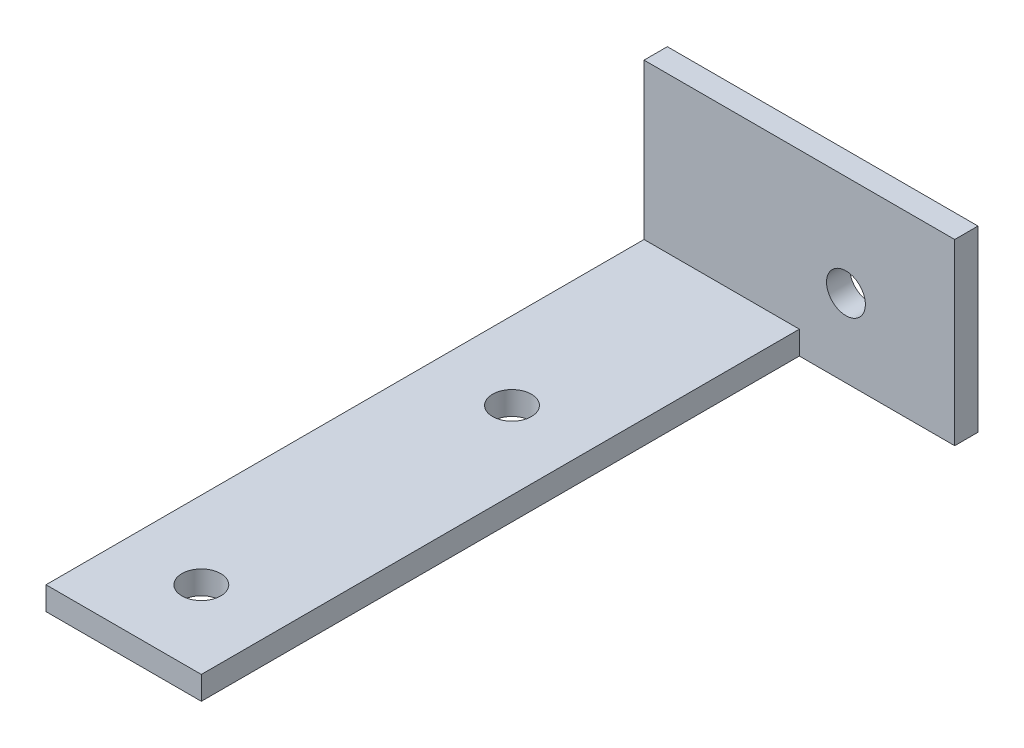
ISO-10303-21;
HEADER;
FILE_DESCRIPTION(('STEP AP214'),'2;1');
FILE_NAME('part.step','',(''),(''),'','','');
FILE_SCHEMA(('AUTOMOTIVE_DESIGN { 1 0 10303 214 1 1 1 1 }'));
ENDSEC;
DATA;
#1=APPLICATION_CONTEXT('core data for automotive mechanical design processes');
#2=APPLICATION_PROTOCOL_DEFINITION('international standard','automotive_design',2000,#1);
#3=PRODUCT_CONTEXT('',#1,'mechanical');
#4=PRODUCT('Part','Part','',(#3));
#5=PRODUCT_RELATED_PRODUCT_CATEGORY('part','',(#4));
#6=PRODUCT_DEFINITION_FORMATION('','',#4);
#7=PRODUCT_DEFINITION_CONTEXT('part definition',#1,'design');
#8=PRODUCT_DEFINITION('design','',#6,#7);
#9=PRODUCT_DEFINITION_SHAPE('','',#8);
#10=(LENGTH_UNIT() NAMED_UNIT(*) SI_UNIT(.MILLI.,.METRE.));
#11=(NAMED_UNIT(*) PLANE_ANGLE_UNIT() SI_UNIT($,.RADIAN.));
#12=(NAMED_UNIT(*) SI_UNIT($,.STERADIAN.) SOLID_ANGLE_UNIT());
#13=UNCERTAINTY_MEASURE_WITH_UNIT(LENGTH_MEASURE(1.E-05),#10,'distance_accuracy_value','');
#14=(GEOMETRIC_REPRESENTATION_CONTEXT(3) GLOBAL_UNCERTAINTY_ASSIGNED_CONTEXT((#13)) GLOBAL_UNIT_ASSIGNED_CONTEXT((#10,
#11,#12)) REPRESENTATION_CONTEXT('',''));
#15=CARTESIAN_POINT('',(0.,0.,0.));
#16=DIRECTION('',(0.,0.,1.));
#17=DIRECTION('',(1.,0.,0.));
#18=AXIS2_PLACEMENT_3D('',#15,#16,#17);
#19=CARTESIAN_POINT('',(10.,3.,-40.));
#20=DIRECTION('',(-1.,0.,0.));
#21=DIRECTION('',(0.,0.,1.));
#22=AXIS2_PLACEMENT_3D('',#19,#20,#21);
#23=PLANE('',#22);
#24=DIRECTION('',(0.,-1.,0.));
#25=VECTOR('',#24,1.);
#26=CARTESIAN_POINT('',(10.,23.,-37.));
#27=LINE('',#26,#25);
#28=CARTESIAN_POINT('',(10.,3.,-37.));
#29=VERTEX_POINT('',#28);
#30=CARTESIAN_POINT('',(10.,0.,-37.));
#31=VERTEX_POINT('',#30);
#32=EDGE_CURVE('E11',#29,#31,#27,.T.);
#33=ORIENTED_EDGE('',*,*,#32,.F.);
#34=DIRECTION('',(0.,0.,-1.));
#35=VECTOR('',#34,1.);
#36=CARTESIAN_POINT('',(10.,3.,-40.));
#37=LINE('',#36,#35);
#38=CARTESIAN_POINT('',(10.,3.,40.));
#39=VERTEX_POINT('',#38);
#40=EDGE_CURVE('E93',#39,#29,#37,.T.);
#41=ORIENTED_EDGE('',*,*,#40,.F.);
#42=DIRECTION('',(0.,-1.,0.));
#43=VECTOR('',#42,1.);
#44=CARTESIAN_POINT('',(10.,3.,40.));
#45=LINE('',#44,#43);
#46=CARTESIAN_POINT('',(10.,0.,40.));
#47=VERTEX_POINT('',#46);
#48=EDGE_CURVE('E85',#39,#47,#45,.T.);
#49=ORIENTED_EDGE('',*,*,#48,.T.);
#50=DIRECTION('',(0.,0.,-1.));
#51=VECTOR('',#50,1.);
#52=CARTESIAN_POINT('',(10.,0.,-40.));
#53=LINE('',#52,#51);
#54=EDGE_CURVE('E100',#47,#31,#53,.T.);
#55=ORIENTED_EDGE('',*,*,#54,.T.);
#56=EDGE_LOOP('',(#33,#41,#49,#55));
#57=FACE_BOUND('',#56,.T.);
#58=ADVANCED_FACE('F43',(#57),#23,.F.);
#59=CARTESIAN_POINT('',(0.,3.,0.));
#60=DIRECTION('',(0.,1.,0.));
#61=DIRECTION('',(0.,0.,1.));
#62=AXIS2_PLACEMENT_3D('',#59,#60,#61);
#63=PLANE('',#62);
#64=DIRECTION('',(1.,0.,0.));
#65=VECTOR('',#64,1.);
#66=CARTESIAN_POINT('',(-10.,3.,-37.));
#67=LINE('',#66,#65);
#68=CARTESIAN_POINT('',(-10.,3.,-37.));
#69=VERTEX_POINT('',#68);
#70=EDGE_CURVE('E60',#69,#29,#67,.T.);
#71=ORIENTED_EDGE('',*,*,#70,.F.);
#72=DIRECTION('',(0.,0.,1.));
#73=VECTOR('',#72,1.);
#74=CARTESIAN_POINT('',(-10.,3.,-40.));
#75=LINE('',#74,#73);
#76=CARTESIAN_POINT('',(-9.99999999999999,3.,40.));
#77=VERTEX_POINT('',#76);
#78=EDGE_CURVE('E193',#69,#77,#75,.T.);
#79=ORIENTED_EDGE('',*,*,#78,.T.);
#80=DIRECTION('',(1.,0.,0.));
#81=VECTOR('',#80,1.);
#82=CARTESIAN_POINT('',(-9.99999999999999,3.,40.));
#83=LINE('',#82,#81);
#84=EDGE_CURVE('E66',#77,#39,#83,.T.);
#85=ORIENTED_EDGE('',*,*,#84,.T.);
#86=ORIENTED_EDGE('',*,*,#40,.T.);
#87=EDGE_LOOP('',(#71,#79,#85,#86));
#88=FACE_BOUND('',#87,.T.);
#89=CARTESIAN_POINT('',(0.,3.,30.));
#90=DIRECTION('',(0.,1.,0.));
#91=DIRECTION('',(0.,0.,1.));
#92=AXIS2_PLACEMENT_3D('',#89,#90,#91);
#93=CIRCLE('',#92,2.5);
#94=CARTESIAN_POINT('',(0.,3.,32.5));
#95=VERTEX_POINT('',#94);
#96=EDGE_CURVE('E111',#95,#95,#93,.T.);
#97=ORIENTED_EDGE('',*,*,#96,.F.);
#98=EDGE_LOOP('',(#97));
#99=FACE_BOUND('',#98,.T.);
#100=CARTESIAN_POINT('',(0.,3.,-10.));
#101=DIRECTION('',(0.,1.,0.));
#102=DIRECTION('',(0.,0.,1.));
#103=AXIS2_PLACEMENT_3D('',#100,#101,#102);
#104=CIRCLE('',#103,2.5);
#105=CARTESIAN_POINT('',(0.,3.,-7.5));
#106=VERTEX_POINT('',#105);
#107=EDGE_CURVE('E182',#106,#106,#104,.T.);
#108=ORIENTED_EDGE('',*,*,#107,.F.);
#109=EDGE_LOOP('',(#108));
#110=FACE_BOUND('',#109,.T.);
#111=ADVANCED_FACE('F196',(#88,#99,#110),#63,.T.);
#112=CARTESIAN_POINT('',(0.,0.,0.));
#113=DIRECTION('',(0.,1.,0.));
#114=DIRECTION('',(0.,0.,1.));
#115=AXIS2_PLACEMENT_3D('',#112,#113,#114);
#116=PLANE('',#115);
#117=ORIENTED_EDGE('',*,*,#54,.F.);
#118=DIRECTION('',(1.,0.,0.));
#119=VECTOR('',#118,1.);
#120=CARTESIAN_POINT('',(-9.99999999999999,0.,40.));
#121=LINE('',#120,#119);
#122=CARTESIAN_POINT('',(-9.99999999999999,0.,40.));
#123=VERTEX_POINT('',#122);
#124=EDGE_CURVE('E82',#123,#47,#121,.T.);
#125=ORIENTED_EDGE('',*,*,#124,.F.);
#126=DIRECTION('',(0.,0.,1.));
#127=VECTOR('',#126,1.);
#128=CARTESIAN_POINT('',(-10.,0.,-40.));
#129=LINE('',#128,#127);
#130=CARTESIAN_POINT('',(-10.,0.,-40.));
#131=VERTEX_POINT('',#130);
#132=EDGE_CURVE('E94',#131,#123,#129,.T.);
#133=ORIENTED_EDGE('',*,*,#132,.F.);
#134=DIRECTION('',(-1.,0.,0.));
#135=VECTOR('',#134,1.);
#136=CARTESIAN_POINT('',(-10.,0.,-40.));
#137=LINE('',#136,#135);
#138=CARTESIAN_POINT('',(30.,0.,-40.));
#139=VERTEX_POINT('',#138);
#140=EDGE_CURVE('E110',#139,#131,#137,.T.);
#141=ORIENTED_EDGE('',*,*,#140,.F.);
#142=DIRECTION('',(0.,0.,-1.));
#143=VECTOR('',#142,1.);
#144=CARTESIAN_POINT('',(30.,0.,-37.));
#145=LINE('',#144,#143);
#146=CARTESIAN_POINT('',(30.,0.,-37.));
#147=VERTEX_POINT('',#146);
#148=EDGE_CURVE('E141',#147,#139,#145,.T.);
#149=ORIENTED_EDGE('',*,*,#148,.F.);
#150=DIRECTION('',(-1.,0.,0.));
#151=VECTOR('',#150,1.);
#152=CARTESIAN_POINT('',(30.,0.,-37.));
#153=LINE('',#152,#151);
#154=EDGE_CURVE('E108',#147,#31,#153,.T.);
#155=ORIENTED_EDGE('',*,*,#154,.T.);
#156=EDGE_LOOP('',(#117,#125,#133,#141,#149,#155));
#157=FACE_BOUND('',#156,.T.);
#158=CARTESIAN_POINT('',(0.,0.,30.));
#159=DIRECTION('',(0.,1.,0.));
#160=DIRECTION('',(0.,0.,1.));
#161=AXIS2_PLACEMENT_3D('',#158,#159,#160);
#162=CIRCLE('',#161,2.5);
#163=CARTESIAN_POINT('',(0.,0.,32.5));
#164=VERTEX_POINT('',#163);
#165=EDGE_CURVE('E117',#164,#164,#162,.T.);
#166=ORIENTED_EDGE('',*,*,#165,.T.);
#167=EDGE_LOOP('',(#166));
#168=FACE_BOUND('',#167,.T.);
#169=CARTESIAN_POINT('',(0.,0.,-10.));
#170=DIRECTION('',(0.,1.,0.));
#171=DIRECTION('',(0.,0.,1.));
#172=AXIS2_PLACEMENT_3D('',#169,#170,#171);
#173=CIRCLE('',#172,2.5);
#174=CARTESIAN_POINT('',(0.,0.,-7.5));
#175=VERTEX_POINT('',#174);
#176=EDGE_CURVE('E181',#175,#175,#173,.T.);
#177=ORIENTED_EDGE('',*,*,#176,.T.);
#178=EDGE_LOOP('',(#177));
#179=FACE_BOUND('',#178,.T.);
#180=ADVANCED_FACE('F104',(#157,#168,#179),#116,.F.);
#181=CARTESIAN_POINT('',(-10.,3.,-40.));
#182=DIRECTION('',(0.,0.,1.));
#183=DIRECTION('',(1.,0.,0.));
#184=AXIS2_PLACEMENT_3D('',#181,#182,#183);
#185=PLANE('',#184);
#186=CARTESIAN_POINT('',(16.,10.,-40.));
#187=DIRECTION('',(0.,0.,-1.));
#188=DIRECTION('',(-1.,0.,0.));
#189=AXIS2_PLACEMENT_3D('',#186,#187,#188);
#190=CIRCLE('',#189,2.5);
#191=CARTESIAN_POINT('',(13.5,10.,-40.));
#192=VERTEX_POINT('',#191);
#193=EDGE_CURVE('E245',#192,#192,#190,.T.);
#194=ORIENTED_EDGE('',*,*,#193,.F.);
#195=EDGE_LOOP('',(#194));
#196=FACE_BOUND('',#195,.T.);
#197=ORIENTED_EDGE('',*,*,#140,.T.);
#198=DIRECTION('',(0.,-1.,0.));
#199=VECTOR('',#198,1.);
#200=CARTESIAN_POINT('',(-10.,3.,-40.));
#201=LINE('',#200,#199);
#202=CARTESIAN_POINT('',(-10.,23.,-40.));
#203=VERTEX_POINT('',#202);
#204=EDGE_CURVE('E52',#203,#131,#201,.T.);
#205=ORIENTED_EDGE('',*,*,#204,.F.);
#206=DIRECTION('',(-1.,0.,0.));
#207=VECTOR('',#206,1.);
#208=CARTESIAN_POINT('',(-10.,23.,-40.));
#209=LINE('',#208,#207);
#210=CARTESIAN_POINT('',(30.,23.,-40.));
#211=VERTEX_POINT('',#210);
#212=EDGE_CURVE('E157',#211,#203,#209,.T.);
#213=ORIENTED_EDGE('',*,*,#212,.F.);
#214=DIRECTION('',(0.,1.,0.));
#215=VECTOR('',#214,1.);
#216=CARTESIAN_POINT('',(30.,23.,-40.));
#217=LINE('',#216,#215);
#218=EDGE_CURVE('E150',#139,#211,#217,.T.);
#219=ORIENTED_EDGE('',*,*,#218,.F.);
#220=EDGE_LOOP('',(#197,#205,#213,#219));
#221=FACE_BOUND('',#220,.T.);
#222=ADVANCED_FACE('F156',(#196,#221),#185,.F.);
#223=CARTESIAN_POINT('',(-10.,3.,-40.));
#224=DIRECTION('',(1.,0.,0.));
#225=DIRECTION('',(0.,0.,-1.));
#226=AXIS2_PLACEMENT_3D('',#223,#224,#225);
#227=PLANE('',#226);
#228=ORIENTED_EDGE('',*,*,#132,.T.);
#229=DIRECTION('',(0.,-1.,0.));
#230=VECTOR('',#229,1.);
#231=CARTESIAN_POINT('',(-9.99999999999999,3.,40.));
#232=LINE('',#231,#230);
#233=EDGE_CURVE('E88',#77,#123,#232,.T.);
#234=ORIENTED_EDGE('',*,*,#233,.F.);
#235=ORIENTED_EDGE('',*,*,#78,.F.);
#236=DIRECTION('',(0.,-1.,0.));
#237=VECTOR('',#236,1.);
#238=CARTESIAN_POINT('',(-10.,23.,-37.));
#239=LINE('',#238,#237);
#240=CARTESIAN_POINT('',(-10.,23.,-37.));
#241=VERTEX_POINT('',#240);
#242=EDGE_CURVE('E175',#241,#69,#239,.T.);
#243=ORIENTED_EDGE('',*,*,#242,.F.);
#244=DIRECTION('',(0.,0.,1.));
#245=VECTOR('',#244,1.);
#246=CARTESIAN_POINT('',(-10.,23.,-40.));
#247=LINE('',#246,#245);
#248=EDGE_CURVE('E133',#203,#241,#247,.T.);
#249=ORIENTED_EDGE('',*,*,#248,.F.);
#250=ORIENTED_EDGE('',*,*,#204,.T.);
#251=EDGE_LOOP('',(#228,#234,#235,#243,#249,#250));
#252=FACE_BOUND('',#251,.T.);
#253=ADVANCED_FACE('F130',(#252),#227,.F.);
#254=CARTESIAN_POINT('',(-9.99999999999999,3.,40.));
#255=DIRECTION('',(0.,0.,-1.));
#256=DIRECTION('',(-1.,0.,0.));
#257=AXIS2_PLACEMENT_3D('',#254,#255,#256);
#258=PLANE('',#257);
#259=ORIENTED_EDGE('',*,*,#124,.T.);
#260=ORIENTED_EDGE('',*,*,#48,.F.);
#261=ORIENTED_EDGE('',*,*,#84,.F.);
#262=ORIENTED_EDGE('',*,*,#233,.T.);
#263=EDGE_LOOP('',(#259,#260,#261,#262));
#264=FACE_BOUND('',#263,.T.);
#265=ADVANCED_FACE('F84',(#264),#258,.F.);
#266=CARTESIAN_POINT('',(0.,3.,30.));
#267=DIRECTION('',(0.,-1.,0.));
#268=DIRECTION('',(0.,0.,-1.));
#269=AXIS2_PLACEMENT_3D('',#266,#267,#268);
#270=CYLINDRICAL_SURFACE('',#269,2.5);
#271=ORIENTED_EDGE('',*,*,#96,.T.);
#272=EDGE_LOOP('',(#271));
#273=FACE_BOUND('',#272,.T.);
#274=ORIENTED_EDGE('',*,*,#165,.F.);
#275=EDGE_LOOP('',(#274));
#276=FACE_BOUND('',#275,.T.);
#277=ADVANCED_FACE('F233',(#273,#276),#270,.F.);
#278=CARTESIAN_POINT('',(0.,3.,-10.));
#279=DIRECTION('',(0.,-1.,0.));
#280=DIRECTION('',(0.,0.,-1.));
#281=AXIS2_PLACEMENT_3D('',#278,#279,#280);
#282=CYLINDRICAL_SURFACE('',#281,2.5);
#283=ORIENTED_EDGE('',*,*,#107,.T.);
#284=EDGE_LOOP('',(#283));
#285=FACE_BOUND('',#284,.T.);
#286=ORIENTED_EDGE('',*,*,#176,.F.);
#287=EDGE_LOOP('',(#286));
#288=FACE_BOUND('',#287,.T.);
#289=ADVANCED_FACE('F220',(#285,#288),#282,.F.);
#290=CARTESIAN_POINT('',(-10.,23.,-37.));
#291=DIRECTION('',(0.,0.,-1.));
#292=DIRECTION('',(-1.,0.,0.));
#293=AXIS2_PLACEMENT_3D('',#290,#291,#292);
#294=PLANE('',#293);
#295=CARTESIAN_POINT('',(16.,10.,-37.));
#296=DIRECTION('',(0.,0.,-1.));
#297=DIRECTION('',(-1.,0.,0.));
#298=AXIS2_PLACEMENT_3D('',#295,#296,#297);
#299=CIRCLE('',#298,2.5);
#300=CARTESIAN_POINT('',(13.5,10.,-37.));
#301=VERTEX_POINT('',#300);
#302=EDGE_CURVE('E46',#301,#301,#299,.T.);
#303=ORIENTED_EDGE('',*,*,#302,.T.);
#304=EDGE_LOOP('',(#303));
#305=FACE_BOUND('',#304,.T.);
#306=ORIENTED_EDGE('',*,*,#70,.T.);
#307=ORIENTED_EDGE('',*,*,#32,.T.);
#308=ORIENTED_EDGE('',*,*,#154,.F.);
#309=DIRECTION('',(0.,-1.,0.));
#310=VECTOR('',#309,1.);
#311=CARTESIAN_POINT('',(30.,23.,-37.));
#312=LINE('',#311,#310);
#313=CARTESIAN_POINT('',(30.,23.,-37.));
#314=VERTEX_POINT('',#313);
#315=EDGE_CURVE('E153',#314,#147,#312,.T.);
#316=ORIENTED_EDGE('',*,*,#315,.F.);
#317=DIRECTION('',(1.,0.,0.));
#318=VECTOR('',#317,1.);
#319=CARTESIAN_POINT('',(-10.,23.,-37.));
#320=LINE('',#319,#318);
#321=EDGE_CURVE('E169',#241,#314,#320,.T.);
#322=ORIENTED_EDGE('',*,*,#321,.F.);
#323=ORIENTED_EDGE('',*,*,#242,.T.);
#324=EDGE_LOOP('',(#306,#307,#308,#316,#322,#323));
#325=FACE_BOUND('',#324,.T.);
#326=ADVANCED_FACE('F201',(#305,#325),#294,.F.);
#327=CARTESIAN_POINT('',(0.,23.,0.));
#328=DIRECTION('',(0.,1.,0.));
#329=DIRECTION('',(0.,0.,1.));
#330=AXIS2_PLACEMENT_3D('',#327,#328,#329);
#331=PLANE('',#330);
#332=ORIENTED_EDGE('',*,*,#248,.T.);
#333=ORIENTED_EDGE('',*,*,#321,.T.);
#334=DIRECTION('',(0.,0.,1.));
#335=VECTOR('',#334,1.);
#336=CARTESIAN_POINT('',(30.,23.,-37.));
#337=LINE('',#336,#335);
#338=EDGE_CURVE('E159',#211,#314,#337,.T.);
#339=ORIENTED_EDGE('',*,*,#338,.F.);
#340=ORIENTED_EDGE('',*,*,#212,.T.);
#341=EDGE_LOOP('',(#332,#333,#339,#340));
#342=FACE_BOUND('',#341,.T.);
#343=ADVANCED_FACE('F206',(#342),#331,.T.);
#344=CARTESIAN_POINT('',(30.,0.,0.));
#345=DIRECTION('',(1.,0.,0.));
#346=DIRECTION('',(0.,0.,-1.));
#347=AXIS2_PLACEMENT_3D('',#344,#345,#346);
#348=PLANE('',#347);
#349=ORIENTED_EDGE('',*,*,#315,.T.);
#350=ORIENTED_EDGE('',*,*,#148,.T.);
#351=ORIENTED_EDGE('',*,*,#218,.T.);
#352=ORIENTED_EDGE('',*,*,#338,.T.);
#353=EDGE_LOOP('',(#349,#350,#351,#352));
#354=FACE_BOUND('',#353,.T.);
#355=ADVANCED_FACE('F148',(#354),#348,.T.);
#356=CARTESIAN_POINT('',(16.,10.,-20.));
#357=DIRECTION('',(0.,0.,-1.));
#358=DIRECTION('',(-1.,0.,0.));
#359=AXIS2_PLACEMENT_3D('',#356,#357,#358);
#360=CYLINDRICAL_SURFACE('',#359,2.5);
#361=ORIENTED_EDGE('',*,*,#193,.T.);
#362=EDGE_LOOP('',(#361));
#363=FACE_BOUND('',#362,.T.);
#364=ORIENTED_EDGE('',*,*,#302,.F.);
#365=EDGE_LOOP('',(#364));
#366=FACE_BOUND('',#365,.T.);
#367=ADVANCED_FACE('F218',(#363,#366),#360,.F.);
#368=CLOSED_SHELL('',(#58,#111,#180,#222,#253,#265,#277,#289,#326,#343,#355,#367));
#369=MANIFOLD_SOLID_BREP('B2',#368);
#370=ADVANCED_BREP_SHAPE_REPRESENTATION('',(#18,#369),#14);
#371=SHAPE_DEFINITION_REPRESENTATION(#9,#370);
ENDSEC;
END-ISO-10303-21;
